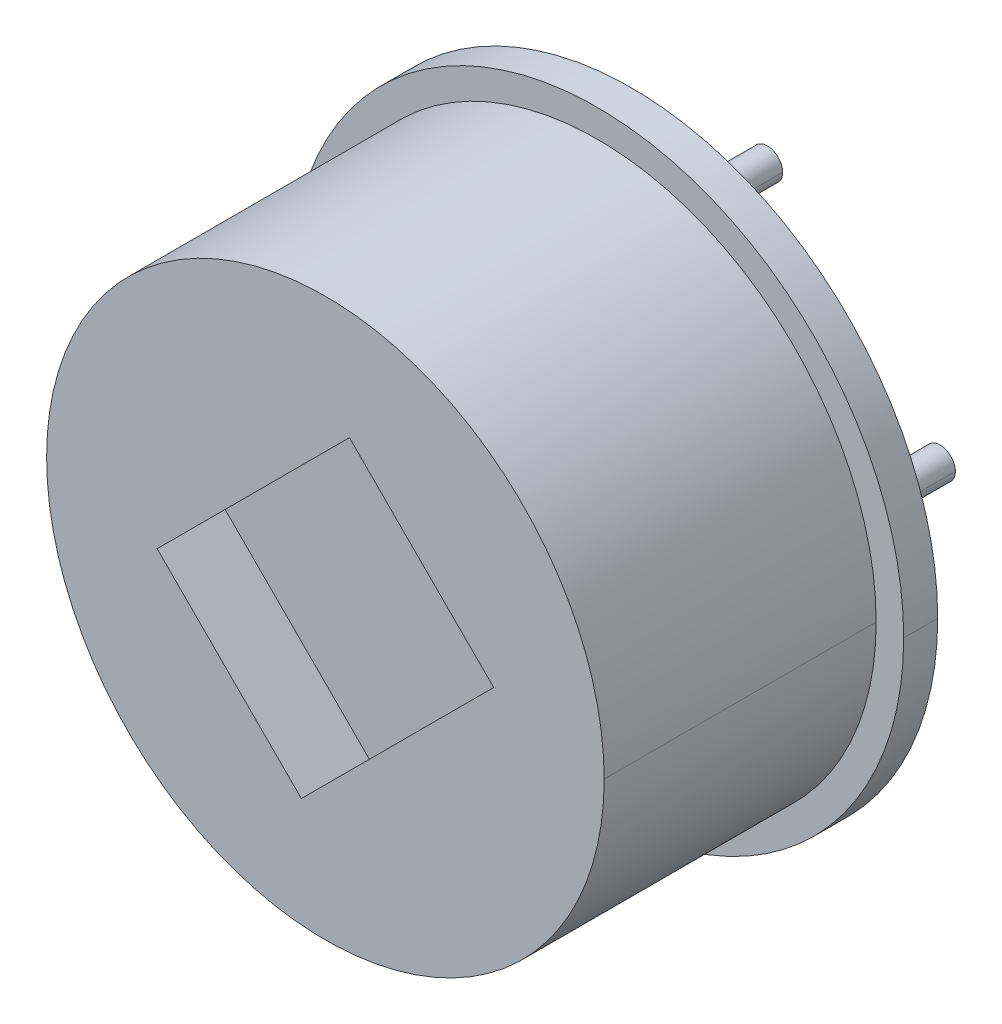
ISO-10303-21;
HEADER;
FILE_DESCRIPTION(('STEP AP214'),'2;1');
FILE_NAME('part.step','',(''),(''),'','','');
FILE_SCHEMA(('AUTOMOTIVE_DESIGN { 1 0 10303 214 1 1 1 1 }'));
ENDSEC;
DATA;
#1=APPLICATION_CONTEXT('core data for automotive mechanical design processes');
#2=APPLICATION_PROTOCOL_DEFINITION('international standard','automotive_design',2000,#1);
#3=PRODUCT_CONTEXT('',#1,'mechanical');
#4=PRODUCT('Part','Part','',(#3));
#5=PRODUCT_RELATED_PRODUCT_CATEGORY('part','',(#4));
#6=PRODUCT_DEFINITION_FORMATION('','',#4);
#7=PRODUCT_DEFINITION_CONTEXT('part definition',#1,'design');
#8=PRODUCT_DEFINITION('design','',#6,#7);
#9=PRODUCT_DEFINITION_SHAPE('','',#8);
#10=(LENGTH_UNIT() NAMED_UNIT(*) SI_UNIT(.MILLI.,.METRE.));
#11=(NAMED_UNIT(*) PLANE_ANGLE_UNIT() SI_UNIT($,.RADIAN.));
#12=(NAMED_UNIT(*) SI_UNIT($,.STERADIAN.) SOLID_ANGLE_UNIT());
#13=UNCERTAINTY_MEASURE_WITH_UNIT(LENGTH_MEASURE(1.E-05),#10,'distance_accuracy_value','');
#14=(GEOMETRIC_REPRESENTATION_CONTEXT(3) GLOBAL_UNCERTAINTY_ASSIGNED_CONTEXT((#13)) GLOBAL_UNIT_ASSIGNED_CONTEXT((#10,
#11,#12)) REPRESENTATION_CONTEXT('',''));
#15=CARTESIAN_POINT('',(0.,0.,0.));
#16=DIRECTION('',(0.,0.,1.));
#17=DIRECTION('',(1.,0.,0.));
#18=AXIS2_PLACEMENT_3D('',#15,#16,#17);
#19=CARTESIAN_POINT('',(0.,0.,3.));
#20=DIRECTION('',(0.,0.,-1.));
#21=DIRECTION('',(0.,-1.,0.));
#22=AXIS2_PLACEMENT_3D('',#19,#20,#21);
#23=PLANE('',#22);
#24=DIRECTION('',(0.707106781186548,-0.707106781186548,0.));
#25=VECTOR('',#24,1.);
#26=CARTESIAN_POINT('',(-0.353553390593303,-2.47487373415272,3.));
#27=LINE('',#26,#25);
#28=CARTESIAN_POINT('',(-2.47487373415294,-0.353553390593071,3.));
#29=VERTEX_POINT('',#28);
#30=CARTESIAN_POINT('',(-0.353553390593303,-2.47487373415272,3.));
#31=VERTEX_POINT('',#30);
#32=EDGE_CURVE('E217',#29,#31,#27,.T.);
#33=ORIENTED_EDGE('',*,*,#32,.T.);
#34=DIRECTION('',(0.707106781186548,0.707106781186548,0.));
#35=VECTOR('',#34,1.);
#36=CARTESIAN_POINT('',(2.47487373415288,0.353553390593477,3.));
#37=LINE('',#36,#35);
#38=CARTESIAN_POINT('',(2.47487373415288,0.353553390593477,3.));
#39=VERTEX_POINT('',#38);
#40=EDGE_CURVE('E9',#31,#39,#37,.T.);
#41=ORIENTED_EDGE('',*,*,#40,.T.);
#42=DIRECTION('',(-0.707106781186548,0.707106781186548,0.));
#43=VECTOR('',#42,1.);
#44=CARTESIAN_POINT('',(0.353553390593244,2.47487373415312,3.));
#45=LINE('',#44,#43);
#46=CARTESIAN_POINT('',(0.353553390593244,2.47487373415312,3.));
#47=VERTEX_POINT('',#46);
#48=EDGE_CURVE('E264',#39,#47,#45,.T.);
#49=ORIENTED_EDGE('',*,*,#48,.T.);
#50=DIRECTION('',(-0.707106781186548,-0.707106781186548,0.));
#51=VECTOR('',#50,1.);
#52=CARTESIAN_POINT('',(-2.47487373415294,-0.353553390593071,3.));
#53=LINE('',#52,#51);
#54=EDGE_CURVE('E265',#47,#29,#53,.T.);
#55=ORIENTED_EDGE('',*,*,#54,.T.);
#56=EDGE_LOOP('',(#33,#41,#49,#55));
#57=FACE_BOUND('',#56,.T.);
#58=ADVANCED_FACE('F15',(#57),#23,.F.);
#59=CARTESIAN_POINT('',(2.47487373415288,0.353553390593477,3.));
#60=DIRECTION('',(0.707106781186548,-0.707106781186548,0.));
#61=DIRECTION('',(0.,0.,-1.));
#62=AXIS2_PLACEMENT_3D('',#59,#60,#61);
#63=PLANE('',#62);
#64=DIRECTION('',(0.707106781186548,0.707106781186548,0.));
#65=VECTOR('',#64,1.);
#66=CARTESIAN_POINT('',(2.47487373415288,0.353553390593477,4.));
#67=LINE('',#66,#65);
#68=CARTESIAN_POINT('',(-0.353553390593302,-2.47487373415272,4.));
#69=VERTEX_POINT('',#68);
#70=CARTESIAN_POINT('',(2.47487373415288,0.353553390593477,4.));
#71=VERTEX_POINT('',#70);
#72=EDGE_CURVE('E222',#69,#71,#67,.T.);
#73=ORIENTED_EDGE('',*,*,#72,.T.);
#74=DIRECTION('',(0.,0.,1.));
#75=VECTOR('',#74,1.);
#76=CARTESIAN_POINT('',(2.47487373415288,0.353553390593477,3.));
#77=LINE('',#76,#75);
#78=EDGE_CURVE('E26',#39,#71,#77,.T.);
#79=ORIENTED_EDGE('',*,*,#78,.F.);
#80=ORIENTED_EDGE('',*,*,#40,.F.);
#81=DIRECTION('',(0.,0.,1.));
#82=VECTOR('',#81,1.);
#83=CARTESIAN_POINT('',(-0.353553390593303,-2.47487373415272,3.));
#84=LINE('',#83,#82);
#85=EDGE_CURVE('E221',#31,#69,#84,.T.);
#86=ORIENTED_EDGE('',*,*,#85,.T.);
#87=EDGE_LOOP('',(#73,#79,#80,#86));
#88=FACE_BOUND('',#87,.T.);
#89=ADVANCED_FACE('F425',(#88),#63,.F.);
#90=CARTESIAN_POINT('',(0.353553390593244,2.47487373415312,3.));
#91=DIRECTION('',(0.707106781186548,0.707106781186548,0.));
#92=DIRECTION('',(0.,0.,-1.));
#93=AXIS2_PLACEMENT_3D('',#90,#91,#92);
#94=PLANE('',#93);
#95=DIRECTION('',(-0.707106781186548,0.707106781186548,0.));
#96=VECTOR('',#95,1.);
#97=CARTESIAN_POINT('',(0.353553390593244,2.47487373415312,4.));
#98=LINE('',#97,#96);
#99=CARTESIAN_POINT('',(0.353553390593244,2.47487373415312,4.));
#100=VERTEX_POINT('',#99);
#101=EDGE_CURVE('E225',#71,#100,#98,.T.);
#102=ORIENTED_EDGE('',*,*,#101,.T.);
#103=DIRECTION('',(0.,0.,1.));
#104=VECTOR('',#103,1.);
#105=CARTESIAN_POINT('',(0.353553390593244,2.47487373415312,3.));
#106=LINE('',#105,#104);
#107=EDGE_CURVE('E260',#47,#100,#106,.T.);
#108=ORIENTED_EDGE('',*,*,#107,.F.);
#109=ORIENTED_EDGE('',*,*,#48,.F.);
#110=ORIENTED_EDGE('',*,*,#78,.T.);
#111=EDGE_LOOP('',(#102,#108,#109,#110));
#112=FACE_BOUND('',#111,.T.);
#113=ADVANCED_FACE('F412',(#112),#94,.F.);
#114=CARTESIAN_POINT('',(-2.47487373415294,-0.353553390593071,3.));
#115=DIRECTION('',(-0.707106781186548,0.707106781186548,0.));
#116=DIRECTION('',(0.,0.,1.));
#117=AXIS2_PLACEMENT_3D('',#114,#115,#116);
#118=PLANE('',#117);
#119=DIRECTION('',(-0.707106781186548,-0.707106781186548,0.));
#120=VECTOR('',#119,1.);
#121=CARTESIAN_POINT('',(-2.47487373415294,-0.353553390593071,4.));
#122=LINE('',#121,#120);
#123=CARTESIAN_POINT('',(-2.47487373415294,-0.353553390593071,4.));
#124=VERTEX_POINT('',#123);
#125=EDGE_CURVE('E276',#100,#124,#122,.T.);
#126=ORIENTED_EDGE('',*,*,#125,.T.);
#127=DIRECTION('',(0.,0.,1.));
#128=VECTOR('',#127,1.);
#129=CARTESIAN_POINT('',(-2.47487373415294,-0.353553390593071,3.));
#130=LINE('',#129,#128);
#131=EDGE_CURVE('E220',#29,#124,#130,.T.);
#132=ORIENTED_EDGE('',*,*,#131,.F.);
#133=ORIENTED_EDGE('',*,*,#54,.F.);
#134=ORIENTED_EDGE('',*,*,#107,.T.);
#135=EDGE_LOOP('',(#126,#132,#133,#134));
#136=FACE_BOUND('',#135,.T.);
#137=ADVANCED_FACE('F405',(#136),#118,.F.);
#138=CARTESIAN_POINT('',(-0.353553390593303,-2.47487373415272,3.));
#139=DIRECTION('',(-0.707106781186548,-0.707106781186548,0.));
#140=DIRECTION('',(-0.707106781186548,0.707106781186548,0.));
#141=AXIS2_PLACEMENT_3D('',#138,#139,#140);
#142=PLANE('',#141);
#143=DIRECTION('',(0.707106781186548,-0.707106781186548,0.));
#144=VECTOR('',#143,1.);
#145=CARTESIAN_POINT('',(-0.353553390593303,-2.47487373415272,4.));
#146=LINE('',#145,#144);
#147=EDGE_CURVE('E282',#124,#69,#146,.T.);
#148=ORIENTED_EDGE('',*,*,#147,.T.);
#149=ORIENTED_EDGE('',*,*,#85,.F.);
#150=ORIENTED_EDGE('',*,*,#32,.F.);
#151=ORIENTED_EDGE('',*,*,#131,.T.);
#152=EDGE_LOOP('',(#148,#149,#150,#151));
#153=FACE_BOUND('',#152,.T.);
#154=ADVANCED_FACE('F419',(#153),#142,.F.);
#155=CARTESIAN_POINT('',(-2.54,0.,-2.5));
#156=DIRECTION('',(0.,0.,-1.));
#157=DIRECTION('',(0.,-1.,0.));
#158=AXIS2_PLACEMENT_3D('',#155,#156,#157);
#159=PLANE('',#158);
#160=CARTESIAN_POINT('',(-2.54,0.,-2.5));
#161=DIRECTION('',(0.,0.,-1.));
#162=DIRECTION('',(-1.,0.,0.));
#163=AXIS2_PLACEMENT_3D('',#160,#161,#162);
#164=CIRCLE('',#163,0.225);
#165=CARTESIAN_POINT('',(-2.315,0.,-2.5));
#166=VERTEX_POINT('',#165);
#167=CARTESIAN_POINT('',(-2.765,0.,-2.5));
#168=VERTEX_POINT('',#167);
#169=EDGE_CURVE('E190',#166,#168,#164,.T.);
#170=ORIENTED_EDGE('',*,*,#169,.T.);
#171=CARTESIAN_POINT('',(-2.54,0.,-2.5));
#172=DIRECTION('',(0.,0.,-1.));
#173=DIRECTION('',(-1.,0.,0.));
#174=AXIS2_PLACEMENT_3D('',#171,#172,#173);
#175=CIRCLE('',#174,0.225);
#176=EDGE_CURVE('E349',#168,#166,#175,.T.);
#177=ORIENTED_EDGE('',*,*,#176,.T.);
#178=EDGE_LOOP('',(#170,#177));
#179=FACE_BOUND('',#178,.T.);
#180=ADVANCED_FACE('F451',(#179),#159,.T.);
#181=CARTESIAN_POINT('',(-2.54,0.,-2.5));
#182=DIRECTION('',(0.,0.,1.));
#183=DIRECTION('',(1.,0.,0.));
#184=AXIS2_PLACEMENT_3D('',#181,#182,#183);
#185=CYLINDRICAL_SURFACE('',#184,0.225);
#186=DIRECTION('',(0.,0.,1.));
#187=VECTOR('',#186,1.);
#188=CARTESIAN_POINT('',(-2.765,0.,-2.5));
#189=LINE('',#188,#187);
#190=CARTESIAN_POINT('',(-2.765,0.,-0.5));
#191=VERTEX_POINT('',#190);
#192=EDGE_CURVE('E302',#168,#191,#189,.T.);
#193=ORIENTED_EDGE('',*,*,#192,.F.);
#194=ORIENTED_EDGE('',*,*,#169,.F.);
#195=DIRECTION('',(0.,0.,1.));
#196=VECTOR('',#195,1.);
#197=CARTESIAN_POINT('',(-2.315,0.,-2.5));
#198=LINE('',#197,#196);
#199=CARTESIAN_POINT('',(-2.315,0.,-0.5));
#200=VERTEX_POINT('',#199);
#201=EDGE_CURVE('E203',#166,#200,#198,.T.);
#202=ORIENTED_EDGE('',*,*,#201,.T.);
#203=CARTESIAN_POINT('',(-2.54,0.,-0.5));
#204=DIRECTION('',(0.,0.,-1.));
#205=DIRECTION('',(-1.,0.,0.));
#206=AXIS2_PLACEMENT_3D('',#203,#204,#205);
#207=CIRCLE('',#206,0.225);
#208=EDGE_CURVE('E241',#200,#191,#207,.T.);
#209=ORIENTED_EDGE('',*,*,#208,.T.);
#210=EDGE_LOOP('',(#193,#194,#202,#209));
#211=FACE_BOUND('',#210,.T.);
#212=ADVANCED_FACE('F373',(#211),#185,.T.);
#213=CARTESIAN_POINT('',(2.54,0.,-2.5));
#214=DIRECTION('',(0.,0.,-1.));
#215=DIRECTION('',(0.,-1.,0.));
#216=AXIS2_PLACEMENT_3D('',#213,#214,#215);
#217=PLANE('',#216);
#218=CARTESIAN_POINT('',(2.54,0.,-2.5));
#219=DIRECTION('',(0.,0.,-1.));
#220=DIRECTION('',(-1.,0.,0.));
#221=AXIS2_PLACEMENT_3D('',#218,#219,#220);
#222=CIRCLE('',#221,0.225);
#223=CARTESIAN_POINT('',(2.765,0.,-2.5));
#224=VERTEX_POINT('',#223);
#225=CARTESIAN_POINT('',(2.315,0.,-2.5));
#226=VERTEX_POINT('',#225);
#227=EDGE_CURVE('E176',#224,#226,#222,.T.);
#228=ORIENTED_EDGE('',*,*,#227,.T.);
#229=CARTESIAN_POINT('',(2.54,0.,-2.5));
#230=DIRECTION('',(0.,0.,-1.));
#231=DIRECTION('',(-1.,0.,0.));
#232=AXIS2_PLACEMENT_3D('',#229,#230,#231);
#233=CIRCLE('',#232,0.225);
#234=EDGE_CURVE('E195',#226,#224,#233,.T.);
#235=ORIENTED_EDGE('',*,*,#234,.T.);
#236=EDGE_LOOP('',(#228,#235));
#237=FACE_BOUND('',#236,.T.);
#238=ADVANCED_FACE('F201',(#237),#217,.T.);
#239=CARTESIAN_POINT('',(2.54,0.,-2.5));
#240=DIRECTION('',(0.,0.,1.));
#241=DIRECTION('',(1.,0.,0.));
#242=AXIS2_PLACEMENT_3D('',#239,#240,#241);
#243=CYLINDRICAL_SURFACE('',#242,0.225);
#244=DIRECTION('',(0.,0.,1.));
#245=VECTOR('',#244,1.);
#246=CARTESIAN_POINT('',(2.315,0.,-2.5));
#247=LINE('',#246,#245);
#248=CARTESIAN_POINT('',(2.315,0.,-0.5));
#249=VERTEX_POINT('',#248);
#250=EDGE_CURVE('E187',#226,#249,#247,.T.);
#251=ORIENTED_EDGE('',*,*,#250,.F.);
#252=ORIENTED_EDGE('',*,*,#227,.F.);
#253=DIRECTION('',(0.,0.,1.));
#254=VECTOR('',#253,1.);
#255=CARTESIAN_POINT('',(2.765,0.,-2.5));
#256=LINE('',#255,#254);
#257=CARTESIAN_POINT('',(2.765,0.,-0.5));
#258=VERTEX_POINT('',#257);
#259=EDGE_CURVE('E184',#224,#258,#256,.T.);
#260=ORIENTED_EDGE('',*,*,#259,.T.);
#261=CARTESIAN_POINT('',(2.54,0.,-0.5));
#262=DIRECTION('',(0.,0.,-1.));
#263=DIRECTION('',(-1.,0.,0.));
#264=AXIS2_PLACEMENT_3D('',#261,#262,#263);
#265=CIRCLE('',#264,0.225);
#266=EDGE_CURVE('E244',#258,#249,#265,.T.);
#267=ORIENTED_EDGE('',*,*,#266,.T.);
#268=EDGE_LOOP('',(#251,#252,#260,#267));
#269=FACE_BOUND('',#268,.T.);
#270=ADVANCED_FACE('F183',(#269),#243,.T.);
#271=CARTESIAN_POINT('',(0.,2.54,-2.5));
#272=DIRECTION('',(0.,0.,-1.));
#273=DIRECTION('',(0.,-1.,0.));
#274=AXIS2_PLACEMENT_3D('',#271,#272,#273);
#275=PLANE('',#274);
#276=CARTESIAN_POINT('',(0.,2.54,-2.5));
#277=DIRECTION('',(0.,0.,-1.));
#278=DIRECTION('',(-1.,0.,0.));
#279=AXIS2_PLACEMENT_3D('',#276,#277,#278);
#280=CIRCLE('',#279,0.225);
#281=CARTESIAN_POINT('',(0.225,2.54,-2.5));
#282=VERTEX_POINT('',#281);
#283=CARTESIAN_POINT('',(-0.225,2.54,-2.5));
#284=VERTEX_POINT('',#283);
#285=EDGE_CURVE('E191',#282,#284,#280,.T.);
#286=ORIENTED_EDGE('',*,*,#285,.T.);
#287=CARTESIAN_POINT('',(0.,2.54,-2.5));
#288=DIRECTION('',(0.,0.,-1.));
#289=DIRECTION('',(-1.,0.,0.));
#290=AXIS2_PLACEMENT_3D('',#287,#288,#289);
#291=CIRCLE('',#290,0.225);
#292=EDGE_CURVE('E199',#284,#282,#291,.T.);
#293=ORIENTED_EDGE('',*,*,#292,.T.);
#294=EDGE_LOOP('',(#286,#293));
#295=FACE_BOUND('',#294,.T.);
#296=ADVANCED_FACE('F437',(#295),#275,.T.);
#297=CARTESIAN_POINT('',(0.,2.54,-2.5));
#298=DIRECTION('',(0.,0.,1.));
#299=DIRECTION('',(1.,0.,0.));
#300=AXIS2_PLACEMENT_3D('',#297,#298,#299);
#301=CYLINDRICAL_SURFACE('',#300,0.225);
#302=DIRECTION('',(0.,0.,1.));
#303=VECTOR('',#302,1.);
#304=CARTESIAN_POINT('',(-0.225,2.54,-2.5));
#305=LINE('',#304,#303);
#306=CARTESIAN_POINT('',(-0.225,2.54,-0.5));
#307=VERTEX_POINT('',#306);
#308=EDGE_CURVE('E226',#284,#307,#305,.T.);
#309=ORIENTED_EDGE('',*,*,#308,.F.);
#310=ORIENTED_EDGE('',*,*,#285,.F.);
#311=DIRECTION('',(0.,0.,1.));
#312=VECTOR('',#311,1.);
#313=CARTESIAN_POINT('',(0.225,2.54,-2.5));
#314=LINE('',#313,#312);
#315=CARTESIAN_POINT('',(0.225,2.54,-0.5));
#316=VERTEX_POINT('',#315);
#317=EDGE_CURVE('E252',#282,#316,#314,.T.);
#318=ORIENTED_EDGE('',*,*,#317,.T.);
#319=CARTESIAN_POINT('',(0.,2.54,-0.5));
#320=DIRECTION('',(0.,0.,-1.));
#321=DIRECTION('',(-1.,0.,0.));
#322=AXIS2_PLACEMENT_3D('',#319,#320,#321);
#323=CIRCLE('',#322,0.225);
#324=EDGE_CURVE('E100',#316,#307,#323,.T.);
#325=ORIENTED_EDGE('',*,*,#324,.T.);
#326=EDGE_LOOP('',(#309,#310,#318,#325));
#327=FACE_BOUND('',#326,.T.);
#328=ADVANCED_FACE('F443',(#327),#301,.T.);
#329=CARTESIAN_POINT('',(0.,0.,0.));
#330=DIRECTION('',(0.,0.,-1.));
#331=DIRECTION('',(0.,-1.,0.));
#332=AXIS2_PLACEMENT_3D('',#329,#330,#331);
#333=PLANE('',#332);
#334=CARTESIAN_POINT('',(0.,0.,0.));
#335=DIRECTION('',(0.,0.,1.));
#336=DIRECTION('',(1.,0.,0.));
#337=AXIS2_PLACEMENT_3D('',#334,#335,#336);
#338=CIRCLE('',#337,4.1);
#339=CARTESIAN_POINT('',(-4.1,0.,0.));
#340=VERTEX_POINT('',#339);
#341=CARTESIAN_POINT('',(4.1,0.,0.));
#342=VERTEX_POINT('',#341);
#343=EDGE_CURVE('E233',#340,#342,#338,.T.);
#344=ORIENTED_EDGE('',*,*,#343,.F.);
#345=CARTESIAN_POINT('',(0.,0.,0.));
#346=DIRECTION('',(0.,0.,1.));
#347=DIRECTION('',(1.,0.,0.));
#348=AXIS2_PLACEMENT_3D('',#345,#346,#347);
#349=CIRCLE('',#348,4.1);
#350=EDGE_CURVE('E289',#342,#340,#349,.T.);
#351=ORIENTED_EDGE('',*,*,#350,.F.);
#352=EDGE_LOOP('',(#344,#351));
#353=FACE_BOUND('',#352,.T.);
#354=CARTESIAN_POINT('',(0.,0.,0.));
#355=DIRECTION('',(0.,0.,-1.));
#356=DIRECTION('',(-1.,0.,0.));
#357=AXIS2_PLACEMENT_3D('',#354,#355,#356);
#358=CIRCLE('',#357,4.505);
#359=CARTESIAN_POINT('',(-3.45577707990179,-2.89009165495242,0.));
#360=VERTEX_POINT('',#359);
#361=CARTESIAN_POINT('',(-4.505,0.,0.));
#362=VERTEX_POINT('',#361);
#363=EDGE_CURVE('E251',#360,#362,#358,.T.);
#364=ORIENTED_EDGE('',*,*,#363,.F.);
#365=DIRECTION('',(0.707106781186677,0.707106781186418,0.));
#366=VECTOR('',#365,1.);
#367=CARTESIAN_POINT('',(-4.02146250485113,-3.45577707990156,0.));
#368=LINE('',#367,#366);
#369=CARTESIAN_POINT('',(-4.02146250485113,-3.45577707990156,0.));
#370=VERTEX_POINT('',#369);
#371=EDGE_CURVE('E122',#370,#360,#368,.T.);
#372=ORIENTED_EDGE('',*,*,#371,.F.);
#373=DIRECTION('',(-0.707106781186544,0.707106781186552,0.));
#374=VECTOR('',#373,1.);
#375=CARTESIAN_POINT('',(-3.4557770799019,-4.0214625048508,0.));
#376=LINE('',#375,#374);
#377=CARTESIAN_POINT('',(-3.4557770799019,-4.0214625048508,0.));
#378=VERTEX_POINT('',#377);
#379=EDGE_CURVE('E259',#378,#370,#376,.T.);
#380=ORIENTED_EDGE('',*,*,#379,.F.);
#381=DIRECTION('',(-0.707106781186551,-0.707106781186544,0.));
#382=VECTOR('',#381,1.);
#383=CARTESIAN_POINT('',(-2.89009165495266,-3.45577707990156,0.));
#384=LINE('',#383,#382);
#385=CARTESIAN_POINT('',(-2.89009165495266,-3.45577707990156,0.));
#386=VERTEX_POINT('',#385);
#387=EDGE_CURVE('E246',#386,#378,#384,.T.);
#388=ORIENTED_EDGE('',*,*,#387,.F.);
#389=CARTESIAN_POINT('',(0.,0.,0.));
#390=DIRECTION('',(0.,0.,-1.));
#391=DIRECTION('',(-1.,0.,0.));
#392=AXIS2_PLACEMENT_3D('',#389,#390,#391);
#393=CIRCLE('',#392,4.505);
#394=CARTESIAN_POINT('',(4.505,0.,0.));
#395=VERTEX_POINT('',#394);
#396=EDGE_CURVE('E295',#395,#386,#393,.T.);
#397=ORIENTED_EDGE('',*,*,#396,.F.);
#398=CARTESIAN_POINT('',(0.,0.,0.));
#399=DIRECTION('',(0.,0.,-1.));
#400=DIRECTION('',(-1.,0.,0.));
#401=AXIS2_PLACEMENT_3D('',#398,#399,#400);
#402=CIRCLE('',#401,4.505);
#403=EDGE_CURVE('E235',#362,#395,#402,.T.);
#404=ORIENTED_EDGE('',*,*,#403,.F.);
#405=EDGE_LOOP('',(#364,#372,#380,#388,#397,#404));
#406=FACE_BOUND('',#405,.T.);
#407=ADVANCED_FACE('F448',(#353,#406),#333,.F.);
#408=CARTESIAN_POINT('',(0.,0.,-0.5));
#409=DIRECTION('',(0.,0.,-1.));
#410=DIRECTION('',(0.,-1.,0.));
#411=AXIS2_PLACEMENT_3D('',#408,#409,#410);
#412=PLANE('',#411);
#413=ORIENTED_EDGE('',*,*,#324,.F.);
#414=CARTESIAN_POINT('',(0.,2.54,-0.5));
#415=DIRECTION('',(0.,0.,-1.));
#416=DIRECTION('',(-1.,0.,0.));
#417=AXIS2_PLACEMENT_3D('',#414,#415,#416);
#418=CIRCLE('',#417,0.225);
#419=EDGE_CURVE('E230',#307,#316,#418,.T.);
#420=ORIENTED_EDGE('',*,*,#419,.F.);
#421=EDGE_LOOP('',(#413,#420));
#422=FACE_BOUND('',#421,.T.);
#423=ORIENTED_EDGE('',*,*,#266,.F.);
#424=CARTESIAN_POINT('',(2.54,0.,-0.5));
#425=DIRECTION('',(0.,0.,-1.));
#426=DIRECTION('',(-1.,0.,0.));
#427=AXIS2_PLACEMENT_3D('',#424,#425,#426);
#428=CIRCLE('',#427,0.225);
#429=EDGE_CURVE('E197',#249,#258,#428,.T.);
#430=ORIENTED_EDGE('',*,*,#429,.F.);
#431=EDGE_LOOP('',(#423,#430));
#432=FACE_BOUND('',#431,.T.);
#433=ORIENTED_EDGE('',*,*,#208,.F.);
#434=CARTESIAN_POINT('',(-2.54,0.,-0.5));
#435=DIRECTION('',(0.,0.,-1.));
#436=DIRECTION('',(-1.,0.,0.));
#437=AXIS2_PLACEMENT_3D('',#434,#435,#436);
#438=CIRCLE('',#437,0.225);
#439=EDGE_CURVE('E213',#191,#200,#438,.T.);
#440=ORIENTED_EDGE('',*,*,#439,.F.);
#441=EDGE_LOOP('',(#433,#440));
#442=FACE_BOUND('',#441,.T.);
#443=CARTESIAN_POINT('',(0.,0.,-0.5));
#444=DIRECTION('',(0.,0.,-1.));
#445=DIRECTION('',(-1.,0.,0.));
#446=AXIS2_PLACEMENT_3D('',#443,#444,#445);
#447=CIRCLE('',#446,4.505);
#448=CARTESIAN_POINT('',(-3.45577707990179,-2.89009165495242,-0.5));
#449=VERTEX_POINT('',#448);
#450=CARTESIAN_POINT('',(-4.505,0.,-0.5));
#451=VERTEX_POINT('',#450);
#452=EDGE_CURVE('E88',#449,#451,#447,.T.);
#453=ORIENTED_EDGE('',*,*,#452,.T.);
#454=CARTESIAN_POINT('',(0.,0.,-0.5));
#455=DIRECTION('',(0.,0.,-1.));
#456=DIRECTION('',(-1.,0.,0.));
#457=AXIS2_PLACEMENT_3D('',#454,#455,#456);
#458=CIRCLE('',#457,4.505);
#459=CARTESIAN_POINT('',(4.505,0.,-0.5));
#460=VERTEX_POINT('',#459);
#461=EDGE_CURVE('E255',#451,#460,#458,.T.);
#462=ORIENTED_EDGE('',*,*,#461,.T.);
#463=CARTESIAN_POINT('',(0.,0.,-0.5));
#464=DIRECTION('',(0.,0.,-1.));
#465=DIRECTION('',(-1.,0.,0.));
#466=AXIS2_PLACEMENT_3D('',#463,#464,#465);
#467=CIRCLE('',#466,4.505);
#468=CARTESIAN_POINT('',(-2.89009165495266,-3.45577707990156,-0.5));
#469=VERTEX_POINT('',#468);
#470=EDGE_CURVE('E296',#460,#469,#467,.T.);
#471=ORIENTED_EDGE('',*,*,#470,.T.);
#472=DIRECTION('',(-0.707106781186551,-0.707106781186544,0.));
#473=VECTOR('',#472,1.);
#474=CARTESIAN_POINT('',(-2.89009165495266,-3.45577707990156,-0.5));
#475=LINE('',#474,#473);
#476=CARTESIAN_POINT('',(-3.4557770799019,-4.0214625048508,-0.5));
#477=VERTEX_POINT('',#476);
#478=EDGE_CURVE('E19',#469,#477,#475,.T.);
#479=ORIENTED_EDGE('',*,*,#478,.T.);
#480=DIRECTION('',(-0.707106781186544,0.707106781186552,0.));
#481=VECTOR('',#480,1.);
#482=CARTESIAN_POINT('',(-3.4557770799019,-4.0214625048508,-0.5));
#483=LINE('',#482,#481);
#484=CARTESIAN_POINT('',(-4.02146250485113,-3.45577707990156,-0.5));
#485=VERTEX_POINT('',#484);
#486=EDGE_CURVE('E138',#477,#485,#483,.T.);
#487=ORIENTED_EDGE('',*,*,#486,.T.);
#488=DIRECTION('',(0.707106781186677,0.707106781186418,0.));
#489=VECTOR('',#488,1.);
#490=CARTESIAN_POINT('',(-4.02146250485113,-3.45577707990156,-0.5));
#491=LINE('',#490,#489);
#492=EDGE_CURVE('E245',#485,#449,#491,.T.);
#493=ORIENTED_EDGE('',*,*,#492,.T.);
#494=EDGE_LOOP('',(#453,#462,#471,#479,#487,#493));
#495=FACE_BOUND('',#494,.T.);
#496=ADVANCED_FACE('F444',(#422,#432,#442,#495),#412,.T.);
#497=CARTESIAN_POINT('',(-4.02146250485113,-3.45577707990156,-0.5));
#498=DIRECTION('',(0.707106781186418,-0.707106781186677,0.));
#499=DIRECTION('',(0.,0.,-1.));
#500=AXIS2_PLACEMENT_3D('',#497,#498,#499);
#501=PLANE('',#500);
#502=ORIENTED_EDGE('',*,*,#371,.T.);
#503=DIRECTION('',(0.,0.,1.));
#504=VECTOR('',#503,1.);
#505=CARTESIAN_POINT('',(-3.45577707990179,-2.89009165495242,-0.5));
#506=LINE('',#505,#504);
#507=EDGE_CURVE('E269',#449,#360,#506,.T.);
#508=ORIENTED_EDGE('',*,*,#507,.F.);
#509=ORIENTED_EDGE('',*,*,#492,.F.);
#510=DIRECTION('',(0.,0.,1.));
#511=VECTOR('',#510,1.);
#512=CARTESIAN_POINT('',(-4.02146250485113,-3.45577707990156,-0.5));
#513=LINE('',#512,#511);
#514=EDGE_CURVE('E256',#485,#370,#513,.T.);
#515=ORIENTED_EDGE('',*,*,#514,.T.);
#516=EDGE_LOOP('',(#502,#508,#509,#515));
#517=FACE_BOUND('',#516,.T.);
#518=ADVANCED_FACE('F447',(#517),#501,.F.);
#519=CARTESIAN_POINT('',(-3.4557770799019,-4.0214625048508,-0.5));
#520=DIRECTION('',(0.707106781186552,0.707106781186544,0.));
#521=DIRECTION('',(0.,0.,-1.));
#522=AXIS2_PLACEMENT_3D('',#519,#520,#521);
#523=PLANE('',#522);
#524=ORIENTED_EDGE('',*,*,#379,.T.);
#525=ORIENTED_EDGE('',*,*,#514,.F.);
#526=ORIENTED_EDGE('',*,*,#486,.F.);
#527=DIRECTION('',(0.,0.,1.));
#528=VECTOR('',#527,1.);
#529=CARTESIAN_POINT('',(-3.4557770799019,-4.0214625048508,-0.5));
#530=LINE('',#529,#528);
#531=EDGE_CURVE('E250',#477,#378,#530,.T.);
#532=ORIENTED_EDGE('',*,*,#531,.T.);
#533=EDGE_LOOP('',(#524,#525,#526,#532));
#534=FACE_BOUND('',#533,.T.);
#535=ADVANCED_FACE('F482',(#534),#523,.F.);
#536=CARTESIAN_POINT('',(-2.89009165495266,-3.45577707990156,-0.5));
#537=DIRECTION('',(-0.707106781186544,0.707106781186551,0.));
#538=DIRECTION('',(0.,0.,1.));
#539=AXIS2_PLACEMENT_3D('',#536,#537,#538);
#540=PLANE('',#539);
#541=ORIENTED_EDGE('',*,*,#387,.T.);
#542=ORIENTED_EDGE('',*,*,#531,.F.);
#543=ORIENTED_EDGE('',*,*,#478,.F.);
#544=DIRECTION('',(0.,0.,1.));
#545=VECTOR('',#544,1.);
#546=CARTESIAN_POINT('',(-2.89009165495266,-3.45577707990156,-0.5));
#547=LINE('',#546,#545);
#548=EDGE_CURVE('E290',#469,#386,#547,.T.);
#549=ORIENTED_EDGE('',*,*,#548,.T.);
#550=EDGE_LOOP('',(#541,#542,#543,#549));
#551=FACE_BOUND('',#550,.T.);
#552=ADVANCED_FACE('F478',(#551),#540,.F.);
#553=CARTESIAN_POINT('',(0.,0.,-0.5));
#554=DIRECTION('',(0.,0.,1.));
#555=DIRECTION('',(1.,0.,0.));
#556=AXIS2_PLACEMENT_3D('',#553,#554,#555);
#557=CYLINDRICAL_SURFACE('',#556,4.505);
#558=DIRECTION('',(0.,0.,1.));
#559=VECTOR('',#558,1.);
#560=CARTESIAN_POINT('',(-4.505,0.,-0.5));
#561=LINE('',#560,#559);
#562=EDGE_CURVE('E240',#451,#362,#561,.T.);
#563=ORIENTED_EDGE('',*,*,#562,.F.);
#564=ORIENTED_EDGE('',*,*,#452,.F.);
#565=ORIENTED_EDGE('',*,*,#507,.T.);
#566=ORIENTED_EDGE('',*,*,#363,.T.);
#567=EDGE_LOOP('',(#563,#564,#565,#566));
#568=FACE_BOUND('',#567,.T.);
#569=ADVANCED_FACE('F481',(#568),#557,.T.);
#570=CARTESIAN_POINT('',(0.,0.,4.));
#571=DIRECTION('',(0.,0.,1.));
#572=DIRECTION('',(1.,0.,0.));
#573=AXIS2_PLACEMENT_3D('',#570,#571,#572);
#574=PLANE('',#573);
#575=ORIENTED_EDGE('',*,*,#147,.F.);
#576=ORIENTED_EDGE('',*,*,#125,.F.);
#577=ORIENTED_EDGE('',*,*,#101,.F.);
#578=ORIENTED_EDGE('',*,*,#72,.F.);
#579=EDGE_LOOP('',(#575,#576,#577,#578));
#580=FACE_BOUND('',#579,.T.);
#581=CARTESIAN_POINT('',(0.,0.,4.));
#582=DIRECTION('',(0.,0.,1.));
#583=DIRECTION('',(1.,0.,0.));
#584=AXIS2_PLACEMENT_3D('',#581,#582,#583);
#585=CIRCLE('',#584,4.1);
#586=CARTESIAN_POINT('',(-4.1,0.,4.));
#587=VERTEX_POINT('',#586);
#588=CARTESIAN_POINT('',(4.1,0.,4.));
#589=VERTEX_POINT('',#588);
#590=EDGE_CURVE('E231',#587,#589,#585,.T.);
#591=ORIENTED_EDGE('',*,*,#590,.T.);
#592=CARTESIAN_POINT('',(0.,0.,4.));
#593=DIRECTION('',(0.,0.,1.));
#594=DIRECTION('',(1.,0.,0.));
#595=AXIS2_PLACEMENT_3D('',#592,#593,#594);
#596=CIRCLE('',#595,4.1);
#597=EDGE_CURVE('E294',#589,#587,#596,.T.);
#598=ORIENTED_EDGE('',*,*,#597,.T.);
#599=EDGE_LOOP('',(#591,#598));
#600=FACE_BOUND('',#599,.T.);
#601=ADVANCED_FACE('F415',(#580,#600),#574,.T.);
#602=CARTESIAN_POINT('',(0.,0.,4.));
#603=DIRECTION('',(0.,0.,-1.));
#604=DIRECTION('',(-1.,0.,0.));
#605=AXIS2_PLACEMENT_3D('',#602,#603,#604);
#606=CYLINDRICAL_SURFACE('',#605,4.1);
#607=DIRECTION('',(0.,0.,-1.));
#608=VECTOR('',#607,1.);
#609=CARTESIAN_POINT('',(4.1,0.,4.));
#610=LINE('',#609,#608);
#611=EDGE_CURVE('E356',#589,#342,#610,.T.);
#612=ORIENTED_EDGE('',*,*,#611,.F.);
#613=ORIENTED_EDGE('',*,*,#590,.F.);
#614=DIRECTION('',(0.,0.,-1.));
#615=VECTOR('',#614,1.);
#616=CARTESIAN_POINT('',(-4.1,0.,4.));
#617=LINE('',#616,#615);
#618=EDGE_CURVE('E234',#587,#340,#617,.T.);
#619=ORIENTED_EDGE('',*,*,#618,.T.);
#620=ORIENTED_EDGE('',*,*,#343,.T.);
#621=EDGE_LOOP('',(#612,#613,#619,#620));
#622=FACE_BOUND('',#621,.T.);
#623=ADVANCED_FACE('F511',(#622),#606,.T.);
#624=CARTESIAN_POINT('',(0.,0.,4.));
#625=DIRECTION('',(0.,0.,-1.));
#626=DIRECTION('',(-1.,0.,0.));
#627=AXIS2_PLACEMENT_3D('',#624,#625,#626);
#628=CYLINDRICAL_SURFACE('',#627,4.1);
#629=ORIENTED_EDGE('',*,*,#597,.F.);
#630=ORIENTED_EDGE('',*,*,#611,.T.);
#631=ORIENTED_EDGE('',*,*,#350,.T.);
#632=ORIENTED_EDGE('',*,*,#618,.F.);
#633=EDGE_LOOP('',(#629,#630,#631,#632));
#634=FACE_BOUND('',#633,.T.);
#635=ADVANCED_FACE('F17',(#634),#628,.T.);
#636=CARTESIAN_POINT('',(0.,0.,-0.5));
#637=DIRECTION('',(0.,0.,1.));
#638=DIRECTION('',(1.,0.,0.));
#639=AXIS2_PLACEMENT_3D('',#636,#637,#638);
#640=CYLINDRICAL_SURFACE('',#639,4.505);
#641=ORIENTED_EDGE('',*,*,#470,.F.);
#642=DIRECTION('',(0.,0.,1.));
#643=VECTOR('',#642,1.);
#644=CARTESIAN_POINT('',(4.505,0.,-0.5));
#645=LINE('',#644,#643);
#646=EDGE_CURVE('E239',#460,#395,#645,.T.);
#647=ORIENTED_EDGE('',*,*,#646,.T.);
#648=ORIENTED_EDGE('',*,*,#396,.T.);
#649=ORIENTED_EDGE('',*,*,#548,.F.);
#650=EDGE_LOOP('',(#641,#647,#648,#649));
#651=FACE_BOUND('',#650,.T.);
#652=ADVANCED_FACE('F476',(#651),#640,.T.);
#653=CARTESIAN_POINT('',(0.,0.,-0.5));
#654=DIRECTION('',(0.,0.,1.));
#655=DIRECTION('',(1.,0.,0.));
#656=AXIS2_PLACEMENT_3D('',#653,#654,#655);
#657=CYLINDRICAL_SURFACE('',#656,4.505);
#658=ORIENTED_EDGE('',*,*,#461,.F.);
#659=ORIENTED_EDGE('',*,*,#562,.T.);
#660=ORIENTED_EDGE('',*,*,#403,.T.);
#661=ORIENTED_EDGE('',*,*,#646,.F.);
#662=EDGE_LOOP('',(#658,#659,#660,#661));
#663=FACE_BOUND('',#662,.T.);
#664=ADVANCED_FACE('F473',(#663),#657,.T.);
#665=CARTESIAN_POINT('',(0.,2.54,-2.5));
#666=DIRECTION('',(0.,0.,1.));
#667=DIRECTION('',(1.,0.,0.));
#668=AXIS2_PLACEMENT_3D('',#665,#666,#667);
#669=CYLINDRICAL_SURFACE('',#668,0.225);
#670=ORIENTED_EDGE('',*,*,#292,.F.);
#671=ORIENTED_EDGE('',*,*,#308,.T.);
#672=ORIENTED_EDGE('',*,*,#419,.T.);
#673=ORIENTED_EDGE('',*,*,#317,.F.);
#674=EDGE_LOOP('',(#670,#671,#672,#673));
#675=FACE_BOUND('',#674,.T.);
#676=ADVANCED_FACE('F441',(#675),#669,.T.);
#677=CARTESIAN_POINT('',(2.54,0.,-2.5));
#678=DIRECTION('',(0.,0.,1.));
#679=DIRECTION('',(1.,0.,0.));
#680=AXIS2_PLACEMENT_3D('',#677,#678,#679);
#681=CYLINDRICAL_SURFACE('',#680,0.225);
#682=ORIENTED_EDGE('',*,*,#234,.F.);
#683=ORIENTED_EDGE('',*,*,#250,.T.);
#684=ORIENTED_EDGE('',*,*,#429,.T.);
#685=ORIENTED_EDGE('',*,*,#259,.F.);
#686=EDGE_LOOP('',(#682,#683,#684,#685));
#687=FACE_BOUND('',#686,.T.);
#688=ADVANCED_FACE('F194',(#687),#681,.T.);
#689=CARTESIAN_POINT('',(-2.54,0.,-2.5));
#690=DIRECTION('',(0.,0.,1.));
#691=DIRECTION('',(1.,0.,0.));
#692=AXIS2_PLACEMENT_3D('',#689,#690,#691);
#693=CYLINDRICAL_SURFACE('',#692,0.225);
#694=ORIENTED_EDGE('',*,*,#176,.F.);
#695=ORIENTED_EDGE('',*,*,#192,.T.);
#696=ORIENTED_EDGE('',*,*,#439,.T.);
#697=ORIENTED_EDGE('',*,*,#201,.F.);
#698=EDGE_LOOP('',(#694,#695,#696,#697));
#699=FACE_BOUND('',#698,.T.);
#700=ADVANCED_FACE('F367',(#699),#693,.T.);
#701=CLOSED_SHELL('',(#58,#89,#113,#137,#154,#180,#212,#238,#270,#296,#328,#407,#496,#518,#535,
#552,#569,#601,#623,#635,#652,#664,#676,#688,#700));
#702=MANIFOLD_SOLID_BREP('B1',#701);
#703=ADVANCED_BREP_SHAPE_REPRESENTATION('',(#18,#702),#14);
#704=SHAPE_DEFINITION_REPRESENTATION(#9,#703);
ENDSEC;
END-ISO-10303-21;
